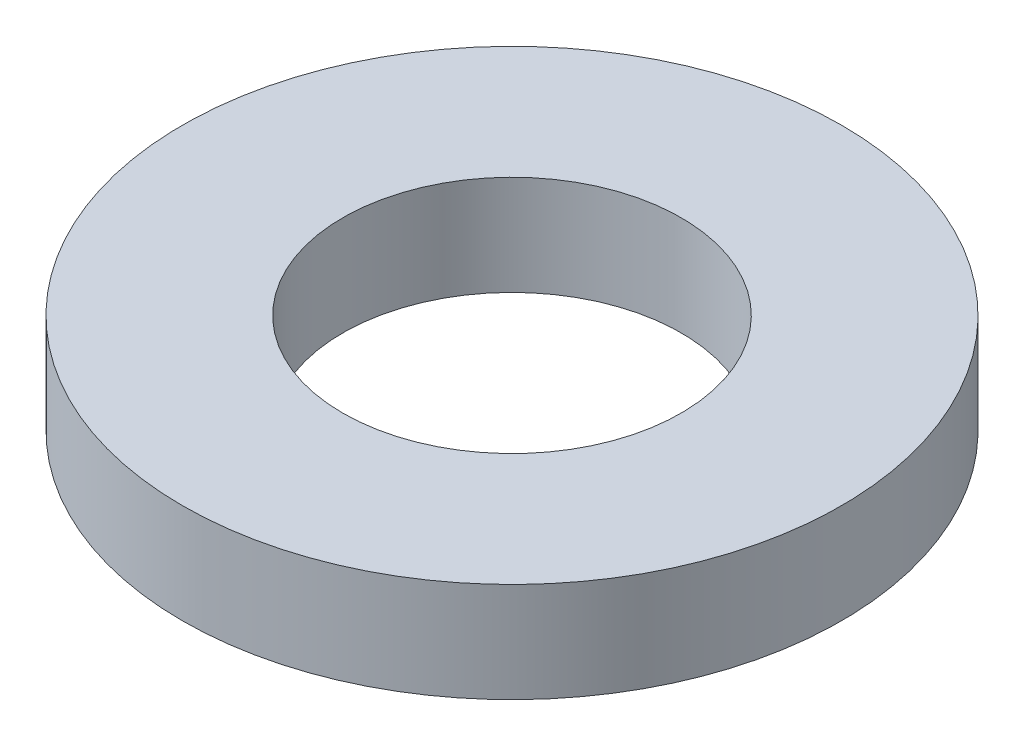
ISO-10303-21;
HEADER;
FILE_DESCRIPTION(('STEP AP214'),'2;1');
FILE_NAME('part.step','',(''),(''),'','','');
FILE_SCHEMA(('AUTOMOTIVE_DESIGN { 1 0 10303 214 1 1 1 1 }'));
ENDSEC;
DATA;
#1=APPLICATION_CONTEXT('core data for automotive mechanical design processes');
#2=APPLICATION_PROTOCOL_DEFINITION('international standard','automotive_design',2000,#1);
#3=PRODUCT_CONTEXT('',#1,'mechanical');
#4=PRODUCT('Part','Part','',(#3));
#5=PRODUCT_RELATED_PRODUCT_CATEGORY('part','',(#4));
#6=PRODUCT_DEFINITION_FORMATION('','',#4);
#7=PRODUCT_DEFINITION_CONTEXT('part definition',#1,'design');
#8=PRODUCT_DEFINITION('design','',#6,#7);
#9=PRODUCT_DEFINITION_SHAPE('','',#8);
#10=(LENGTH_UNIT() NAMED_UNIT(*) SI_UNIT(.MILLI.,.METRE.));
#11=(NAMED_UNIT(*) PLANE_ANGLE_UNIT() SI_UNIT($,.RADIAN.));
#12=(NAMED_UNIT(*) SI_UNIT($,.STERADIAN.) SOLID_ANGLE_UNIT());
#13=UNCERTAINTY_MEASURE_WITH_UNIT(LENGTH_MEASURE(1.E-05),#10,'distance_accuracy_value','');
#14=(GEOMETRIC_REPRESENTATION_CONTEXT(3) GLOBAL_UNCERTAINTY_ASSIGNED_CONTEXT((#13)) GLOBAL_UNIT_ASSIGNED_CONTEXT((#10,
#11,#12)) REPRESENTATION_CONTEXT('',''));
#15=CARTESIAN_POINT('',(0.,0.,0.));
#16=DIRECTION('',(0.,0.,1.));
#17=DIRECTION('',(1.,0.,0.));
#18=AXIS2_PLACEMENT_3D('',#15,#16,#17);
#19=CARTESIAN_POINT('',(0.,28.,0.));
#20=DIRECTION('',(0.,-1.,0.));
#21=DIRECTION('',(0.,0.,-1.));
#22=AXIS2_PLACEMENT_3D('',#19,#20,#21);
#23=CYLINDRICAL_SURFACE('',#22,92.5);
#24=CARTESIAN_POINT('',(0.,28.,0.));
#25=DIRECTION('',(0.,1.,0.));
#26=DIRECTION('',(0.,0.,1.));
#27=AXIS2_PLACEMENT_3D('',#24,#25,#26);
#28=CIRCLE('',#27,92.5);
#29=CARTESIAN_POINT('',(0.,28.,92.5));
#30=VERTEX_POINT('',#29);
#31=EDGE_CURVE('E10',#30,#30,#28,.T.);
#32=ORIENTED_EDGE('',*,*,#31,.F.);
#33=EDGE_LOOP('',(#32));
#34=FACE_BOUND('',#33,.T.);
#35=CARTESIAN_POINT('',(0.,0.,0.));
#36=DIRECTION('',(0.,1.,0.));
#37=DIRECTION('',(0.,0.,1.));
#38=AXIS2_PLACEMENT_3D('',#35,#36,#37);
#39=CIRCLE('',#38,92.5);
#40=CARTESIAN_POINT('',(0.,0.,92.5));
#41=VERTEX_POINT('',#40);
#42=EDGE_CURVE('E37',#41,#41,#39,.T.);
#43=ORIENTED_EDGE('',*,*,#42,.T.);
#44=EDGE_LOOP('',(#43));
#45=FACE_BOUND('',#44,.T.);
#46=ADVANCED_FACE('F40',(#34,#45),#23,.T.);
#47=CARTESIAN_POINT('',(0.,28.,0.));
#48=DIRECTION('',(0.,1.,0.));
#49=DIRECTION('',(0.,0.,1.));
#50=AXIS2_PLACEMENT_3D('',#47,#48,#49);
#51=PLANE('',#50);
#52=CARTESIAN_POINT('',(0.,28.,0.));
#53=DIRECTION('',(0.,1.,0.));
#54=DIRECTION('',(0.,0.,1.));
#55=AXIS2_PLACEMENT_3D('',#52,#53,#54);
#56=CIRCLE('',#55,47.5);
#57=CARTESIAN_POINT('',(0.,28.,47.5));
#58=VERTEX_POINT('',#57);
#59=EDGE_CURVE('E50',#58,#58,#56,.T.);
#60=ORIENTED_EDGE('',*,*,#59,.F.);
#61=EDGE_LOOP('',(#60));
#62=FACE_BOUND('',#61,.T.);
#63=ORIENTED_EDGE('',*,*,#31,.T.);
#64=EDGE_LOOP('',(#63));
#65=FACE_BOUND('',#64,.T.);
#66=ADVANCED_FACE('F59',(#62,#65),#51,.T.);
#67=CARTESIAN_POINT('',(0.,0.,0.));
#68=DIRECTION('',(0.,1.,0.));
#69=DIRECTION('',(0.,0.,1.));
#70=AXIS2_PLACEMENT_3D('',#67,#68,#69);
#71=PLANE('',#70);
#72=CARTESIAN_POINT('',(0.,0.,0.));
#73=DIRECTION('',(0.,1.,0.));
#74=DIRECTION('',(0.,0.,1.));
#75=AXIS2_PLACEMENT_3D('',#72,#73,#74);
#76=CIRCLE('',#75,47.5);
#77=CARTESIAN_POINT('',(0.,0.,47.5));
#78=VERTEX_POINT('',#77);
#79=EDGE_CURVE('E47',#78,#78,#76,.T.);
#80=ORIENTED_EDGE('',*,*,#79,.T.);
#81=EDGE_LOOP('',(#80));
#82=FACE_BOUND('',#81,.T.);
#83=ORIENTED_EDGE('',*,*,#42,.F.);
#84=EDGE_LOOP('',(#83));
#85=FACE_BOUND('',#84,.T.);
#86=ADVANCED_FACE('F58',(#82,#85),#71,.F.);
#87=CARTESIAN_POINT('',(0.,28.,0.));
#88=DIRECTION('',(0.,-1.,0.));
#89=DIRECTION('',(0.,0.,-1.));
#90=AXIS2_PLACEMENT_3D('',#87,#88,#89);
#91=CYLINDRICAL_SURFACE('',#90,47.5);
#92=ORIENTED_EDGE('',*,*,#59,.T.);
#93=EDGE_LOOP('',(#92));
#94=FACE_BOUND('',#93,.T.);
#95=ORIENTED_EDGE('',*,*,#79,.F.);
#96=EDGE_LOOP('',(#95));
#97=FACE_BOUND('',#96,.T.);
#98=ADVANCED_FACE('F54',(#94,#97),#91,.F.);
#99=CLOSED_SHELL('',(#46,#66,#86,#98));
#100=MANIFOLD_SOLID_BREP('B2',#99);
#101=ADVANCED_BREP_SHAPE_REPRESENTATION('',(#18,#100),#14);
#102=SHAPE_DEFINITION_REPRESENTATION(#9,#101);
ENDSEC;
END-ISO-10303-21;
